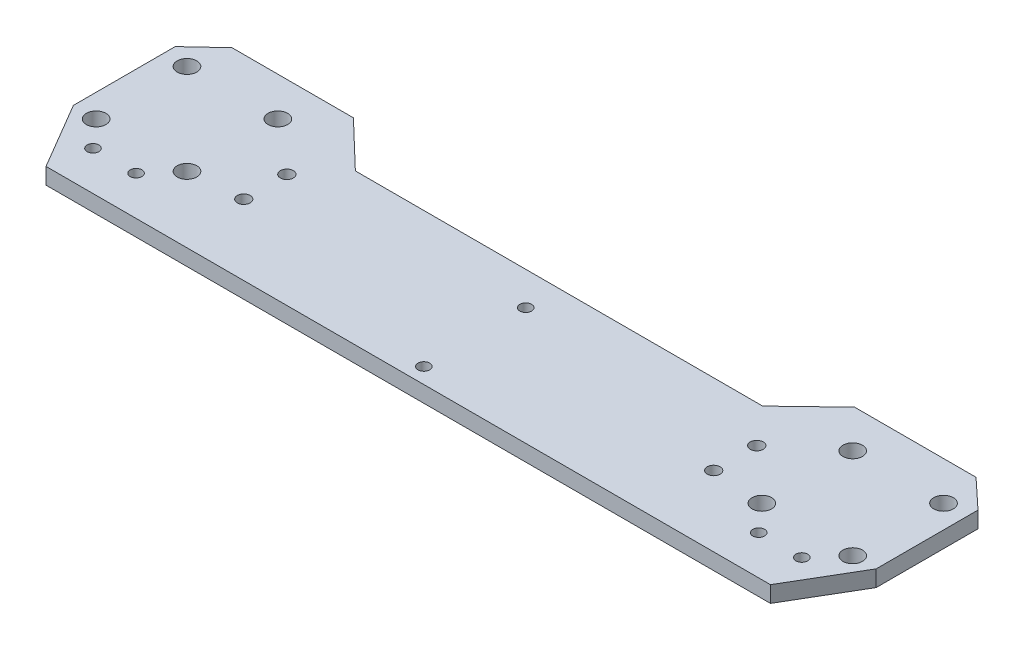
ISO-10303-21;
HEADER;
FILE_DESCRIPTION(('STEP AP214'),'2;1');
FILE_NAME('part.step','',(''),(''),'','','');
FILE_SCHEMA(('AUTOMOTIVE_DESIGN { 1 0 10303 214 1 1 1 1 }'));
ENDSEC;
DATA;
#1=APPLICATION_CONTEXT('core data for automotive mechanical design processes');
#2=APPLICATION_PROTOCOL_DEFINITION('international standard','automotive_design',2000,#1);
#3=PRODUCT_CONTEXT('',#1,'mechanical');
#4=PRODUCT('Part','Part','',(#3));
#5=PRODUCT_RELATED_PRODUCT_CATEGORY('part','',(#4));
#6=PRODUCT_DEFINITION_FORMATION('','',#4);
#7=PRODUCT_DEFINITION_CONTEXT('part definition',#1,'design');
#8=PRODUCT_DEFINITION('design','',#6,#7);
#9=PRODUCT_DEFINITION_SHAPE('','',#8);
#10=(LENGTH_UNIT() NAMED_UNIT(*) SI_UNIT(.MILLI.,.METRE.));
#11=(NAMED_UNIT(*) PLANE_ANGLE_UNIT() SI_UNIT($,.RADIAN.));
#12=(NAMED_UNIT(*) SI_UNIT($,.STERADIAN.) SOLID_ANGLE_UNIT());
#13=UNCERTAINTY_MEASURE_WITH_UNIT(LENGTH_MEASURE(1.E-05),#10,'distance_accuracy_value','');
#14=(GEOMETRIC_REPRESENTATION_CONTEXT(3) GLOBAL_UNCERTAINTY_ASSIGNED_CONTEXT((#13)) GLOBAL_UNIT_ASSIGNED_CONTEXT((#10,
#11,#12)) REPRESENTATION_CONTEXT('',''));
#15=CARTESIAN_POINT('',(0.,0.,0.));
#16=DIRECTION('',(0.,0.,1.));
#17=DIRECTION('',(1.,0.,0.));
#18=AXIS2_PLACEMENT_3D('',#15,#16,#17);
#19=CARTESIAN_POINT('',(64.,-209.15,-50.));
#20=DIRECTION('',(0.,0.,-1.));
#21=DIRECTION('',(-1.,0.,0.));
#22=AXIS2_PLACEMENT_3D('',#19,#20,#21);
#23=PLANE('',#22);
#24=DIRECTION('',(-1.,0.,0.));
#25=VECTOR('',#24,1.);
#26=CARTESIAN_POINT('',(64.,-205.,-50.));
#27=LINE('',#26,#25);
#28=CARTESIAN_POINT('',(95.,-205.,-50.));
#29=VERTEX_POINT('',#28);
#30=CARTESIAN_POINT('',(64.,-205.,-50.));
#31=VERTEX_POINT('',#30);
#32=EDGE_CURVE('E157',#29,#31,#27,.T.);
#33=ORIENTED_EDGE('',*,*,#32,.F.);
#34=DIRECTION('',(0.,1.,0.));
#35=VECTOR('',#34,1.);
#36=CARTESIAN_POINT('',(95.,-209.15,-50.));
#37=LINE('',#36,#35);
#38=CARTESIAN_POINT('',(95.,-209.15,-50.));
#39=VERTEX_POINT('',#38);
#40=EDGE_CURVE('E11',#39,#29,#37,.T.);
#41=ORIENTED_EDGE('',*,*,#40,.F.);
#42=DIRECTION('',(-1.,0.,0.));
#43=VECTOR('',#42,1.);
#44=CARTESIAN_POINT('',(64.,-209.15,-50.));
#45=LINE('',#44,#43);
#46=CARTESIAN_POINT('',(64.,-209.15,-50.));
#47=VERTEX_POINT('',#46);
#48=EDGE_CURVE('E190',#39,#47,#45,.T.);
#49=ORIENTED_EDGE('',*,*,#48,.T.);
#50=DIRECTION('',(0.,1.,0.));
#51=VECTOR('',#50,1.);
#52=CARTESIAN_POINT('',(64.,-209.15,-50.));
#53=LINE('',#52,#51);
#54=EDGE_CURVE('E39',#47,#31,#53,.T.);
#55=ORIENTED_EDGE('',*,*,#54,.T.);
#56=EDGE_LOOP('',(#33,#41,#49,#55));
#57=FACE_BOUND('',#56,.T.);
#58=ADVANCED_FACE('F36',(#57),#23,.T.);
#59=CARTESIAN_POINT('',(95.,-209.15,-50.));
#60=DIRECTION('',(0.682318250360011,0.,-0.731055268242869));
#61=DIRECTION('',(-0.731055268242869,0.,-0.682318250360011));
#62=AXIS2_PLACEMENT_3D('',#59,#60,#61);
#63=PLANE('',#62);
#64=DIRECTION('',(-0.731055268242869,0.,-0.682318250360011));
#65=VECTOR('',#64,1.);
#66=CARTESIAN_POINT('',(95.,-205.,-50.));
#67=LINE('',#66,#65);
#68=CARTESIAN_POINT('',(102.5,-205.,-43.));
#69=VERTEX_POINT('',#68);
#70=EDGE_CURVE('E188',#69,#29,#67,.T.);
#71=ORIENTED_EDGE('',*,*,#70,.F.);
#72=DIRECTION('',(0.,1.,0.));
#73=VECTOR('',#72,1.);
#74=CARTESIAN_POINT('',(102.5,-209.15,-43.));
#75=LINE('',#74,#73);
#76=CARTESIAN_POINT('',(102.5,-209.15,-43.));
#77=VERTEX_POINT('',#76);
#78=EDGE_CURVE('E45',#77,#69,#75,.T.);
#79=ORIENTED_EDGE('',*,*,#78,.F.);
#80=DIRECTION('',(-0.731055268242869,0.,-0.682318250360011));
#81=VECTOR('',#80,1.);
#82=CARTESIAN_POINT('',(95.,-209.15,-50.));
#83=LINE('',#82,#81);
#84=EDGE_CURVE('E147',#77,#39,#83,.T.);
#85=ORIENTED_EDGE('',*,*,#84,.T.);
#86=ORIENTED_EDGE('',*,*,#40,.T.);
#87=EDGE_LOOP('',(#71,#79,#85,#86));
#88=FACE_BOUND('',#87,.T.);
#89=ADVANCED_FACE('F210',(#88),#63,.T.);
#90=CARTESIAN_POINT('',(102.5,-209.15,-43.));
#91=DIRECTION('',(1.,0.,0.));
#92=DIRECTION('',(0.,0.,-1.));
#93=AXIS2_PLACEMENT_3D('',#90,#91,#92);
#94=PLANE('',#93);
#95=DIRECTION('',(0.,0.,-1.));
#96=VECTOR('',#95,1.);
#97=CARTESIAN_POINT('',(102.5,-205.,-43.));
#98=LINE('',#97,#96);
#99=CARTESIAN_POINT('',(102.5,-205.,-17.));
#100=VERTEX_POINT('',#99);
#101=EDGE_CURVE('E134',#100,#69,#98,.T.);
#102=ORIENTED_EDGE('',*,*,#101,.F.);
#103=DIRECTION('',(0.,1.,0.));
#104=VECTOR('',#103,1.);
#105=CARTESIAN_POINT('',(102.5,-209.15,-17.));
#106=LINE('',#105,#104);
#107=CARTESIAN_POINT('',(102.5,-209.15,-17.));
#108=VERTEX_POINT('',#107);
#109=EDGE_CURVE('E129',#108,#100,#106,.T.);
#110=ORIENTED_EDGE('',*,*,#109,.F.);
#111=DIRECTION('',(0.,0.,-1.));
#112=VECTOR('',#111,1.);
#113=CARTESIAN_POINT('',(102.5,-209.15,-43.));
#114=LINE('',#113,#112);
#115=EDGE_CURVE('E132',#108,#77,#114,.T.);
#116=ORIENTED_EDGE('',*,*,#115,.T.);
#117=ORIENTED_EDGE('',*,*,#78,.T.);
#118=EDGE_LOOP('',(#102,#110,#116,#117));
#119=FACE_BOUND('',#118,.T.);
#120=ADVANCED_FACE('F131',(#119),#94,.T.);
#121=CARTESIAN_POINT('',(102.5,-209.15,-17.));
#122=DIRECTION('',(0.86193421515777,0.,0.507020126563394));
#123=DIRECTION('',(0.507020126563394,0.,-0.86193421515777));
#124=AXIS2_PLACEMENT_3D('',#121,#122,#123);
#125=PLANE('',#124);
#126=DIRECTION('',(0.507020126563394,0.,-0.86193421515777));
#127=VECTOR('',#126,1.);
#128=CARTESIAN_POINT('',(102.5,-205.,-17.));
#129=LINE('',#128,#127);
#130=CARTESIAN_POINT('',(92.5,-205.,0.));
#131=VERTEX_POINT('',#130);
#132=EDGE_CURVE('E185',#131,#100,#129,.T.);
#133=ORIENTED_EDGE('',*,*,#132,.F.);
#134=DIRECTION('',(0.,1.,0.));
#135=VECTOR('',#134,1.);
#136=CARTESIAN_POINT('',(92.5,-209.15,0.));
#137=LINE('',#136,#135);
#138=CARTESIAN_POINT('',(92.5,-209.15,0.));
#139=VERTEX_POINT('',#138);
#140=EDGE_CURVE('E139',#139,#131,#137,.T.);
#141=ORIENTED_EDGE('',*,*,#140,.F.);
#142=DIRECTION('',(0.507020126563394,0.,-0.86193421515777));
#143=VECTOR('',#142,1.);
#144=CARTESIAN_POINT('',(102.5,-209.15,-17.));
#145=LINE('',#144,#143);
#146=EDGE_CURVE('E145',#139,#108,#145,.T.);
#147=ORIENTED_EDGE('',*,*,#146,.T.);
#148=ORIENTED_EDGE('',*,*,#109,.T.);
#149=EDGE_LOOP('',(#133,#141,#147,#148));
#150=FACE_BOUND('',#149,.T.);
#151=ADVANCED_FACE('F149',(#150),#125,.T.);
#152=CARTESIAN_POINT('',(-92.5,-209.15,0.));
#153=DIRECTION('',(0.,0.,1.));
#154=DIRECTION('',(1.,0.,0.));
#155=AXIS2_PLACEMENT_3D('',#152,#153,#154);
#156=PLANE('',#155);
#157=DIRECTION('',(1.,0.,0.));
#158=VECTOR('',#157,1.);
#159=CARTESIAN_POINT('',(-92.5,-205.,0.));
#160=LINE('',#159,#158);
#161=CARTESIAN_POINT('',(-92.5,-205.,0.));
#162=VERTEX_POINT('',#161);
#163=EDGE_CURVE('E182',#162,#131,#160,.T.);
#164=ORIENTED_EDGE('',*,*,#163,.F.);
#165=DIRECTION('',(0.,1.,0.));
#166=VECTOR('',#165,1.);
#167=CARTESIAN_POINT('',(-92.5,-209.15,0.));
#168=LINE('',#167,#166);
#169=CARTESIAN_POINT('',(-92.5,-209.15,0.));
#170=VERTEX_POINT('',#169);
#171=EDGE_CURVE('E194',#170,#162,#168,.T.);
#172=ORIENTED_EDGE('',*,*,#171,.F.);
#173=DIRECTION('',(1.,0.,0.));
#174=VECTOR('',#173,1.);
#175=CARTESIAN_POINT('',(-92.5,-209.15,0.));
#176=LINE('',#175,#174);
#177=EDGE_CURVE('E150',#170,#139,#176,.T.);
#178=ORIENTED_EDGE('',*,*,#177,.T.);
#179=ORIENTED_EDGE('',*,*,#140,.T.);
#180=EDGE_LOOP('',(#164,#172,#178,#179));
#181=FACE_BOUND('',#180,.T.);
#182=ADVANCED_FACE('F223',(#181),#156,.T.);
#183=CARTESIAN_POINT('',(-102.5,-209.15,-17.));
#184=DIRECTION('',(-0.86193421515777,0.,0.507020126563394));
#185=DIRECTION('',(0.507020126563394,0.,0.86193421515777));
#186=AXIS2_PLACEMENT_3D('',#183,#184,#185);
#187=PLANE('',#186);
#188=DIRECTION('',(0.507020126563394,0.,0.86193421515777));
#189=VECTOR('',#188,1.);
#190=CARTESIAN_POINT('',(-102.5,-205.,-17.));
#191=LINE('',#190,#189);
#192=CARTESIAN_POINT('',(-102.5,-205.,-17.));
#193=VERTEX_POINT('',#192);
#194=EDGE_CURVE('E179',#193,#162,#191,.T.);
#195=ORIENTED_EDGE('',*,*,#194,.F.);
#196=DIRECTION('',(0.,1.,0.));
#197=VECTOR('',#196,1.);
#198=CARTESIAN_POINT('',(-102.5,-209.15,-17.));
#199=LINE('',#198,#197);
#200=CARTESIAN_POINT('',(-102.5,-209.15,-17.));
#201=VERTEX_POINT('',#200);
#202=EDGE_CURVE('E196',#201,#193,#199,.T.);
#203=ORIENTED_EDGE('',*,*,#202,.F.);
#204=DIRECTION('',(0.507020126563394,0.,0.86193421515777));
#205=VECTOR('',#204,1.);
#206=CARTESIAN_POINT('',(-102.5,-209.15,-17.));
#207=LINE('',#206,#205);
#208=EDGE_CURVE('E152',#201,#170,#207,.T.);
#209=ORIENTED_EDGE('',*,*,#208,.T.);
#210=ORIENTED_EDGE('',*,*,#171,.T.);
#211=EDGE_LOOP('',(#195,#203,#209,#210));
#212=FACE_BOUND('',#211,.T.);
#213=ADVANCED_FACE('F226',(#212),#187,.T.);
#214=CARTESIAN_POINT('',(-102.5,-209.15,-43.));
#215=DIRECTION('',(-1.,0.,0.));
#216=DIRECTION('',(0.,0.,1.));
#217=AXIS2_PLACEMENT_3D('',#214,#215,#216);
#218=PLANE('',#217);
#219=DIRECTION('',(0.,0.,1.));
#220=VECTOR('',#219,1.);
#221=CARTESIAN_POINT('',(-102.5,-205.,-43.));
#222=LINE('',#221,#220);
#223=CARTESIAN_POINT('',(-102.5,-205.,-43.));
#224=VERTEX_POINT('',#223);
#225=EDGE_CURVE('E176',#224,#193,#222,.T.);
#226=ORIENTED_EDGE('',*,*,#225,.F.);
#227=DIRECTION('',(0.,1.,0.));
#228=VECTOR('',#227,1.);
#229=CARTESIAN_POINT('',(-102.5,-209.15,-43.));
#230=LINE('',#229,#228);
#231=CARTESIAN_POINT('',(-102.5,-209.15,-43.));
#232=VERTEX_POINT('',#231);
#233=EDGE_CURVE('E198',#232,#224,#230,.T.);
#234=ORIENTED_EDGE('',*,*,#233,.F.);
#235=DIRECTION('',(0.,0.,1.));
#236=VECTOR('',#235,1.);
#237=CARTESIAN_POINT('',(-102.5,-209.15,-43.));
#238=LINE('',#237,#236);
#239=EDGE_CURVE('E460',#232,#201,#238,.T.);
#240=ORIENTED_EDGE('',*,*,#239,.T.);
#241=ORIENTED_EDGE('',*,*,#202,.T.);
#242=EDGE_LOOP('',(#226,#234,#240,#241));
#243=FACE_BOUND('',#242,.T.);
#244=ADVANCED_FACE('F230',(#243),#218,.T.);
#245=CARTESIAN_POINT('',(-95.,-209.15,-50.));
#246=DIRECTION('',(-0.682318250360011,0.,-0.731055268242869));
#247=DIRECTION('',(-0.731055268242869,0.,0.682318250360011));
#248=AXIS2_PLACEMENT_3D('',#245,#246,#247);
#249=PLANE('',#248);
#250=DIRECTION('',(-0.731055268242869,0.,0.682318250360011));
#251=VECTOR('',#250,1.);
#252=CARTESIAN_POINT('',(-95.,-205.,-50.));
#253=LINE('',#252,#251);
#254=CARTESIAN_POINT('',(-95.,-205.,-50.));
#255=VERTEX_POINT('',#254);
#256=EDGE_CURVE('E173',#255,#224,#253,.T.);
#257=ORIENTED_EDGE('',*,*,#256,.F.);
#258=DIRECTION('',(0.,1.,0.));
#259=VECTOR('',#258,1.);
#260=CARTESIAN_POINT('',(-95.,-209.15,-50.));
#261=LINE('',#260,#259);
#262=CARTESIAN_POINT('',(-95.,-209.15,-50.));
#263=VERTEX_POINT('',#262);
#264=EDGE_CURVE('E200',#263,#255,#261,.T.);
#265=ORIENTED_EDGE('',*,*,#264,.F.);
#266=DIRECTION('',(-0.731055268242869,0.,0.682318250360011));
#267=VECTOR('',#266,1.);
#268=CARTESIAN_POINT('',(-95.,-209.15,-50.));
#269=LINE('',#268,#267);
#270=EDGE_CURVE('E457',#263,#232,#269,.T.);
#271=ORIENTED_EDGE('',*,*,#270,.T.);
#272=ORIENTED_EDGE('',*,*,#233,.T.);
#273=EDGE_LOOP('',(#257,#265,#271,#272));
#274=FACE_BOUND('',#273,.T.);
#275=ADVANCED_FACE('F234',(#274),#249,.T.);
#276=CARTESIAN_POINT('',(-64.,-209.15,-50.));
#277=DIRECTION('',(0.,0.,-1.));
#278=DIRECTION('',(-1.,0.,0.));
#279=AXIS2_PLACEMENT_3D('',#276,#277,#278);
#280=PLANE('',#279);
#281=DIRECTION('',(-1.,0.,0.));
#282=VECTOR('',#281,1.);
#283=CARTESIAN_POINT('',(-64.,-205.,-50.));
#284=LINE('',#283,#282);
#285=CARTESIAN_POINT('',(-64.,-205.,-50.));
#286=VERTEX_POINT('',#285);
#287=EDGE_CURVE('E170',#286,#255,#284,.T.);
#288=ORIENTED_EDGE('',*,*,#287,.F.);
#289=DIRECTION('',(0.,1.,0.));
#290=VECTOR('',#289,1.);
#291=CARTESIAN_POINT('',(-64.,-209.15,-50.));
#292=LINE('',#291,#290);
#293=CARTESIAN_POINT('',(-64.,-209.15,-50.));
#294=VERTEX_POINT('',#293);
#295=EDGE_CURVE('E202',#294,#286,#292,.T.);
#296=ORIENTED_EDGE('',*,*,#295,.F.);
#297=DIRECTION('',(-1.,0.,0.));
#298=VECTOR('',#297,1.);
#299=CARTESIAN_POINT('',(-64.,-209.15,-50.));
#300=LINE('',#299,#298);
#301=EDGE_CURVE('E454',#294,#263,#300,.T.);
#302=ORIENTED_EDGE('',*,*,#301,.T.);
#303=ORIENTED_EDGE('',*,*,#264,.T.);
#304=EDGE_LOOP('',(#288,#296,#302,#303));
#305=FACE_BOUND('',#304,.T.);
#306=ADVANCED_FACE('F238',(#305),#280,.T.);
#307=CARTESIAN_POINT('',(-52.,-209.15,-38.5));
#308=DIRECTION('',(0.691905363235614,0.,-0.721988205115425));
#309=DIRECTION('',(-0.721988205115425,0.,-0.691905363235614));
#310=AXIS2_PLACEMENT_3D('',#307,#308,#309);
#311=PLANE('',#310);
#312=DIRECTION('',(-0.721988205115425,0.,-0.691905363235614));
#313=VECTOR('',#312,1.);
#314=CARTESIAN_POINT('',(-52.,-205.,-38.5));
#315=LINE('',#314,#313);
#316=CARTESIAN_POINT('',(-52.,-205.,-38.5));
#317=VERTEX_POINT('',#316);
#318=EDGE_CURVE('E167',#317,#286,#315,.T.);
#319=ORIENTED_EDGE('',*,*,#318,.F.);
#320=DIRECTION('',(0.,1.,0.));
#321=VECTOR('',#320,1.);
#322=CARTESIAN_POINT('',(-52.,-209.15,-38.5));
#323=LINE('',#322,#321);
#324=CARTESIAN_POINT('',(-52.,-209.15,-38.5));
#325=VERTEX_POINT('',#324);
#326=EDGE_CURVE('E204',#325,#317,#323,.T.);
#327=ORIENTED_EDGE('',*,*,#326,.F.);
#328=DIRECTION('',(-0.721988205115425,0.,-0.691905363235614));
#329=VECTOR('',#328,1.);
#330=CARTESIAN_POINT('',(-52.,-209.15,-38.5));
#331=LINE('',#330,#329);
#332=EDGE_CURVE('E451',#325,#294,#331,.T.);
#333=ORIENTED_EDGE('',*,*,#332,.T.);
#334=ORIENTED_EDGE('',*,*,#295,.T.);
#335=EDGE_LOOP('',(#319,#327,#333,#334));
#336=FACE_BOUND('',#335,.T.);
#337=ADVANCED_FACE('F242',(#336),#311,.T.);
#338=CARTESIAN_POINT('',(52.,-209.15,-38.5));
#339=DIRECTION('',(0.,0.,-1.));
#340=DIRECTION('',(-1.,0.,0.));
#341=AXIS2_PLACEMENT_3D('',#338,#339,#340);
#342=PLANE('',#341);
#343=DIRECTION('',(-1.,0.,0.));
#344=VECTOR('',#343,1.);
#345=CARTESIAN_POINT('',(52.,-205.,-38.5));
#346=LINE('',#345,#344);
#347=CARTESIAN_POINT('',(52.,-205.,-38.5));
#348=VERTEX_POINT('',#347);
#349=EDGE_CURVE('E164',#348,#317,#346,.T.);
#350=ORIENTED_EDGE('',*,*,#349,.F.);
#351=DIRECTION('',(0.,1.,0.));
#352=VECTOR('',#351,1.);
#353=CARTESIAN_POINT('',(52.,-209.15,-38.5));
#354=LINE('',#353,#352);
#355=CARTESIAN_POINT('',(52.,-209.15,-38.5));
#356=VERTEX_POINT('',#355);
#357=EDGE_CURVE('E205',#356,#348,#354,.T.);
#358=ORIENTED_EDGE('',*,*,#357,.F.);
#359=DIRECTION('',(-1.,0.,0.));
#360=VECTOR('',#359,1.);
#361=CARTESIAN_POINT('',(52.,-209.15,-38.5));
#362=LINE('',#361,#360);
#363=EDGE_CURVE('E448',#356,#325,#362,.T.);
#364=ORIENTED_EDGE('',*,*,#363,.T.);
#365=ORIENTED_EDGE('',*,*,#326,.T.);
#366=EDGE_LOOP('',(#350,#358,#364,#365));
#367=FACE_BOUND('',#366,.T.);
#368=ADVANCED_FACE('F246',(#367),#342,.T.);
#369=CARTESIAN_POINT('',(52.,-209.15,-38.5));
#370=DIRECTION('',(-0.691905363235614,0.,-0.721988205115425));
#371=DIRECTION('',(-0.721988205115425,0.,0.691905363235614));
#372=AXIS2_PLACEMENT_3D('',#369,#370,#371);
#373=PLANE('',#372);
#374=DIRECTION('',(-0.721988205115425,0.,0.691905363235614));
#375=VECTOR('',#374,1.);
#376=CARTESIAN_POINT('',(52.,-205.,-38.5));
#377=LINE('',#376,#375);
#378=EDGE_CURVE('E160',#31,#348,#377,.T.);
#379=ORIENTED_EDGE('',*,*,#378,.F.);
#380=ORIENTED_EDGE('',*,*,#54,.F.);
#381=DIRECTION('',(-0.721988205115425,0.,0.691905363235614));
#382=VECTOR('',#381,1.);
#383=CARTESIAN_POINT('',(52.,-209.15,-38.5));
#384=LINE('',#383,#382);
#385=EDGE_CURVE('E446',#47,#356,#384,.T.);
#386=ORIENTED_EDGE('',*,*,#385,.T.);
#387=ORIENTED_EDGE('',*,*,#357,.T.);
#388=EDGE_LOOP('',(#379,#380,#386,#387));
#389=FACE_BOUND('',#388,.T.);
#390=ADVANCED_FACE('F207',(#389),#373,.T.);
#391=CARTESIAN_POINT('',(0.,-209.15,0.));
#392=DIRECTION('',(0.,-1.,0.));
#393=DIRECTION('',(0.,0.,-1.));
#394=AXIS2_PLACEMENT_3D('',#391,#392,#393);
#395=PLANE('',#394);
#396=CARTESIAN_POINT('',(-96.6,-209.15,-40.1));
#397=DIRECTION('',(0.,1.,0.));
#398=DIRECTION('',(0.,0.,1.));
#399=AXIS2_PLACEMENT_3D('',#396,#397,#398);
#400=CIRCLE('',#399,2.50000000000001);
#401=CARTESIAN_POINT('',(-96.6,-209.15,-37.6));
#402=VERTEX_POINT('',#401);
#403=EDGE_CURVE('E337',#402,#402,#400,.T.);
#404=ORIENTED_EDGE('',*,*,#403,.T.);
#405=EDGE_LOOP('',(#404));
#406=FACE_BOUND('',#405,.T.);
#407=CARTESIAN_POINT('',(96.6,-209.15,-40.1));
#408=DIRECTION('',(0.,1.,0.));
#409=DIRECTION('',(0.,0.,-1.));
#410=AXIS2_PLACEMENT_3D('',#407,#408,#409);
#411=CIRCLE('',#410,2.49999999999997);
#412=CARTESIAN_POINT('',(96.6,-209.15,-42.6));
#413=VERTEX_POINT('',#412);
#414=EDGE_CURVE('E345',#413,#413,#411,.T.);
#415=ORIENTED_EDGE('',*,*,#414,.T.);
#416=EDGE_LOOP('',(#415));
#417=FACE_BOUND('',#416,.T.);
#418=CARTESIAN_POINT('',(96.6,-209.15,-16.9));
#419=DIRECTION('',(0.,1.,0.));
#420=DIRECTION('',(0.,0.,-1.));
#421=AXIS2_PLACEMENT_3D('',#418,#419,#420);
#422=CIRCLE('',#421,2.49999999999997);
#423=CARTESIAN_POINT('',(96.6,-209.15,-19.4));
#424=VERTEX_POINT('',#423);
#425=EDGE_CURVE('E351',#424,#424,#422,.T.);
#426=ORIENTED_EDGE('',*,*,#425,.T.);
#427=EDGE_LOOP('',(#426));
#428=FACE_BOUND('',#427,.T.);
#429=CARTESIAN_POINT('',(90.5,-209.15,-10.));
#430=DIRECTION('',(0.,1.,0.));
#431=DIRECTION('',(0.,0.,-1.));
#432=AXIS2_PLACEMENT_3D('',#429,#430,#431);
#433=CIRCLE('',#432,1.49999999999997);
#434=CARTESIAN_POINT('',(90.5,-209.15,-11.5));
#435=VERTEX_POINT('',#434);
#436=EDGE_CURVE('E357',#435,#435,#433,.T.);
#437=ORIENTED_EDGE('',*,*,#436,.T.);
#438=EDGE_LOOP('',(#437));
#439=FACE_BOUND('',#438,.T.);
#440=CARTESIAN_POINT('',(79.5,-209.15,-10.));
#441=DIRECTION('',(0.,1.,0.));
#442=DIRECTION('',(0.,0.,-1.));
#443=AXIS2_PLACEMENT_3D('',#440,#441,#442);
#444=CIRCLE('',#443,1.50000000000003);
#445=CARTESIAN_POINT('',(79.5,-209.15,-11.5));
#446=VERTEX_POINT('',#445);
#447=EDGE_CURVE('E363',#446,#446,#444,.T.);
#448=ORIENTED_EDGE('',*,*,#447,.T.);
#449=EDGE_LOOP('',(#448));
#450=FACE_BOUND('',#449,.T.);
#451=CARTESIAN_POINT('',(73.4,-209.15,-16.9));
#452=DIRECTION('',(0.,1.,0.));
#453=DIRECTION('',(0.,0.,-1.));
#454=AXIS2_PLACEMENT_3D('',#451,#452,#453);
#455=CIRCLE('',#454,2.49999999999997);
#456=CARTESIAN_POINT('',(73.4,-209.15,-19.4));
#457=VERTEX_POINT('',#456);
#458=EDGE_CURVE('E369',#457,#457,#455,.T.);
#459=ORIENTED_EDGE('',*,*,#458,.T.);
#460=EDGE_LOOP('',(#459));
#461=FACE_BOUND('',#460,.T.);
#462=CARTESIAN_POINT('',(60.,-209.15,-18.));
#463=DIRECTION('',(0.,1.,0.));
#464=DIRECTION('',(0.,0.,-1.));
#465=AXIS2_PLACEMENT_3D('',#462,#463,#464);
#466=CIRCLE('',#465,1.65000000000001);
#467=CARTESIAN_POINT('',(60.,-209.15,-19.65));
#468=VERTEX_POINT('',#467);
#469=EDGE_CURVE('E375',#468,#468,#466,.T.);
#470=ORIENTED_EDGE('',*,*,#469,.T.);
#471=EDGE_LOOP('',(#470));
#472=FACE_BOUND('',#471,.T.);
#473=CARTESIAN_POINT('',(60.,-209.15,-29.));
#474=DIRECTION('',(0.,1.,0.));
#475=DIRECTION('',(0.,0.,-1.));
#476=AXIS2_PLACEMENT_3D('',#473,#474,#475);
#477=CIRCLE('',#476,1.65000000000002);
#478=CARTESIAN_POINT('',(60.,-209.15,-30.65));
#479=VERTEX_POINT('',#478);
#480=EDGE_CURVE('E381',#479,#479,#477,.T.);
#481=ORIENTED_EDGE('',*,*,#480,.T.);
#482=EDGE_LOOP('',(#481));
#483=FACE_BOUND('',#482,.T.);
#484=CARTESIAN_POINT('',(73.4,-209.15,-40.1));
#485=DIRECTION('',(0.,1.,0.));
#486=DIRECTION('',(0.,0.,-1.));
#487=AXIS2_PLACEMENT_3D('',#484,#485,#486);
#488=CIRCLE('',#487,2.49999999999997);
#489=CARTESIAN_POINT('',(73.4,-209.15,-42.6));
#490=VERTEX_POINT('',#489);
#491=EDGE_CURVE('E387',#490,#490,#488,.T.);
#492=ORIENTED_EDGE('',*,*,#491,.T.);
#493=EDGE_LOOP('',(#492));
#494=FACE_BOUND('',#493,.T.);
#495=CARTESIAN_POINT('',(0.,-209.15,-4.00000000000001));
#496=DIRECTION('',(0.,1.,0.));
#497=DIRECTION('',(0.,0.,1.));
#498=AXIS2_PLACEMENT_3D('',#495,#496,#497);
#499=CIRCLE('',#498,1.5);
#500=CARTESIAN_POINT('',(0.,-209.15,-2.50000000000002));
#501=VERTEX_POINT('',#500);
#502=EDGE_CURVE('E393',#501,#501,#499,.T.);
#503=ORIENTED_EDGE('',*,*,#502,.T.);
#504=EDGE_LOOP('',(#503));
#505=FACE_BOUND('',#504,.T.);
#506=CARTESIAN_POINT('',(0.,-209.15,-30.));
#507=DIRECTION('',(0.,1.,0.));
#508=DIRECTION('',(0.,0.,1.));
#509=AXIS2_PLACEMENT_3D('',#506,#507,#508);
#510=CIRCLE('',#509,1.5);
#511=CARTESIAN_POINT('',(0.,-209.15,-28.5));
#512=VERTEX_POINT('',#511);
#513=EDGE_CURVE('E399',#512,#512,#510,.T.);
#514=ORIENTED_EDGE('',*,*,#513,.T.);
#515=EDGE_LOOP('',(#514));
#516=FACE_BOUND('',#515,.T.);
#517=CARTESIAN_POINT('',(-60.,-209.15,-18.));
#518=DIRECTION('',(0.,1.,0.));
#519=DIRECTION('',(0.,0.,1.));
#520=AXIS2_PLACEMENT_3D('',#517,#518,#519);
#521=CIRCLE('',#520,1.65000000000001);
#522=CARTESIAN_POINT('',(-60.,-209.15,-16.35));
#523=VERTEX_POINT('',#522);
#524=EDGE_CURVE('E405',#523,#523,#521,.T.);
#525=ORIENTED_EDGE('',*,*,#524,.T.);
#526=EDGE_LOOP('',(#525));
#527=FACE_BOUND('',#526,.T.);
#528=CARTESIAN_POINT('',(-60.,-209.15,-29.));
#529=DIRECTION('',(0.,1.,0.));
#530=DIRECTION('',(0.,0.,1.));
#531=AXIS2_PLACEMENT_3D('',#528,#529,#530);
#532=CIRCLE('',#531,1.65000000000002);
#533=CARTESIAN_POINT('',(-60.,-209.15,-27.35));
#534=VERTEX_POINT('',#533);
#535=EDGE_CURVE('E411',#534,#534,#532,.T.);
#536=ORIENTED_EDGE('',*,*,#535,.T.);
#537=EDGE_LOOP('',(#536));
#538=FACE_BOUND('',#537,.T.);
#539=CARTESIAN_POINT('',(-79.5,-209.15,-9.99999999999999));
#540=DIRECTION('',(0.,1.,0.));
#541=DIRECTION('',(0.,0.,1.));
#542=AXIS2_PLACEMENT_3D('',#539,#540,#541);
#543=CIRCLE('',#542,1.5);
#544=CARTESIAN_POINT('',(-79.5,-209.15,-8.5));
#545=VERTEX_POINT('',#544);
#546=EDGE_CURVE('E417',#545,#545,#543,.T.);
#547=ORIENTED_EDGE('',*,*,#546,.T.);
#548=EDGE_LOOP('',(#547));
#549=FACE_BOUND('',#548,.T.);
#550=CARTESIAN_POINT('',(-90.5,-209.15,-9.99999999999999));
#551=DIRECTION('',(0.,1.,0.));
#552=DIRECTION('',(0.,0.,1.));
#553=AXIS2_PLACEMENT_3D('',#550,#551,#552);
#554=CIRCLE('',#553,1.5);
#555=CARTESIAN_POINT('',(-90.5,-209.15,-8.49999999999999));
#556=VERTEX_POINT('',#555);
#557=EDGE_CURVE('E423',#556,#556,#554,.T.);
#558=ORIENTED_EDGE('',*,*,#557,.T.);
#559=EDGE_LOOP('',(#558));
#560=FACE_BOUND('',#559,.T.);
#561=CARTESIAN_POINT('',(-73.4,-209.15,-16.9));
#562=DIRECTION('',(0.,1.,0.));
#563=DIRECTION('',(0.,0.,1.));
#564=AXIS2_PLACEMENT_3D('',#561,#562,#563);
#565=CIRCLE('',#564,2.50000000000001);
#566=CARTESIAN_POINT('',(-73.4,-209.15,-14.4));
#567=VERTEX_POINT('',#566);
#568=EDGE_CURVE('E429',#567,#567,#565,.T.);
#569=ORIENTED_EDGE('',*,*,#568,.T.);
#570=EDGE_LOOP('',(#569));
#571=FACE_BOUND('',#570,.T.);
#572=CARTESIAN_POINT('',(-96.6,-209.15,-16.9));
#573=DIRECTION('',(0.,1.,0.));
#574=DIRECTION('',(0.,0.,1.));
#575=AXIS2_PLACEMENT_3D('',#572,#573,#574);
#576=CIRCLE('',#575,2.49999999999999);
#577=CARTESIAN_POINT('',(-96.6,-209.15,-14.4));
#578=VERTEX_POINT('',#577);
#579=EDGE_CURVE('E435',#578,#578,#576,.T.);
#580=ORIENTED_EDGE('',*,*,#579,.T.);
#581=EDGE_LOOP('',(#580));
#582=FACE_BOUND('',#581,.T.);
#583=CARTESIAN_POINT('',(-73.4,-209.15,-40.1));
#584=DIRECTION('',(0.,1.,0.));
#585=DIRECTION('',(0.,0.,1.));
#586=AXIS2_PLACEMENT_3D('',#583,#584,#585);
#587=CIRCLE('',#586,2.49999999999999);
#588=CARTESIAN_POINT('',(-73.4,-209.15,-37.6));
#589=VERTEX_POINT('',#588);
#590=EDGE_CURVE('E161',#589,#589,#587,.T.);
#591=ORIENTED_EDGE('',*,*,#590,.T.);
#592=EDGE_LOOP('',(#591));
#593=FACE_BOUND('',#592,.T.);
#594=ORIENTED_EDGE('',*,*,#48,.F.);
#595=ORIENTED_EDGE('',*,*,#84,.F.);
#596=ORIENTED_EDGE('',*,*,#115,.F.);
#597=ORIENTED_EDGE('',*,*,#146,.F.);
#598=ORIENTED_EDGE('',*,*,#177,.F.);
#599=ORIENTED_EDGE('',*,*,#208,.F.);
#600=ORIENTED_EDGE('',*,*,#239,.F.);
#601=ORIENTED_EDGE('',*,*,#270,.F.);
#602=ORIENTED_EDGE('',*,*,#301,.F.);
#603=ORIENTED_EDGE('',*,*,#332,.F.);
#604=ORIENTED_EDGE('',*,*,#363,.F.);
#605=ORIENTED_EDGE('',*,*,#385,.F.);
#606=EDGE_LOOP('',(#594,#595,#596,#597,#598,#599,#600,#601,#602,#603,#604,#605));
#607=FACE_BOUND('',#606,.T.);
#608=ADVANCED_FACE('F143',(#406,#417,#428,#439,#450,#461,#472,#483,#494,#505,#516,#527,#538,
#549,#560,#571,#582,#593,#607),#395,.T.);
#609=CARTESIAN_POINT('',(0.,-205.,0.));
#610=DIRECTION('',(0.,-1.,0.));
#611=DIRECTION('',(0.,0.,-1.));
#612=AXIS2_PLACEMENT_3D('',#609,#610,#611);
#613=PLANE('',#612);
#614=CARTESIAN_POINT('',(-96.6,-205.,-40.1));
#615=DIRECTION('',(0.,1.,0.));
#616=DIRECTION('',(0.,0.,1.));
#617=AXIS2_PLACEMENT_3D('',#614,#615,#616);
#618=CIRCLE('',#617,2.50000000000001);
#619=CARTESIAN_POINT('',(-96.6,-205.,-37.6));
#620=VERTEX_POINT('',#619);
#621=EDGE_CURVE('E340',#620,#620,#618,.T.);
#622=ORIENTED_EDGE('',*,*,#621,.F.);
#623=EDGE_LOOP('',(#622));
#624=FACE_BOUND('',#623,.T.);
#625=CARTESIAN_POINT('',(96.6,-205.,-40.1));
#626=DIRECTION('',(0.,1.,0.));
#627=DIRECTION('',(0.,0.,-1.));
#628=AXIS2_PLACEMENT_3D('',#625,#626,#627);
#629=CIRCLE('',#628,2.49999999999997);
#630=CARTESIAN_POINT('',(96.6,-205.,-42.6));
#631=VERTEX_POINT('',#630);
#632=EDGE_CURVE('E342',#631,#631,#629,.T.);
#633=ORIENTED_EDGE('',*,*,#632,.F.);
#634=EDGE_LOOP('',(#633));
#635=FACE_BOUND('',#634,.T.);
#636=CARTESIAN_POINT('',(96.6,-205.,-16.9));
#637=DIRECTION('',(0.,1.,0.));
#638=DIRECTION('',(0.,0.,-1.));
#639=AXIS2_PLACEMENT_3D('',#636,#637,#638);
#640=CIRCLE('',#639,2.49999999999997);
#641=CARTESIAN_POINT('',(96.6,-205.,-19.4));
#642=VERTEX_POINT('',#641);
#643=EDGE_CURVE('E348',#642,#642,#640,.T.);
#644=ORIENTED_EDGE('',*,*,#643,.F.);
#645=EDGE_LOOP('',(#644));
#646=FACE_BOUND('',#645,.T.);
#647=CARTESIAN_POINT('',(90.5,-205.,-10.));
#648=DIRECTION('',(0.,1.,0.));
#649=DIRECTION('',(0.,0.,-1.));
#650=AXIS2_PLACEMENT_3D('',#647,#648,#649);
#651=CIRCLE('',#650,1.49999999999997);
#652=CARTESIAN_POINT('',(90.5,-205.,-11.5));
#653=VERTEX_POINT('',#652);
#654=EDGE_CURVE('E354',#653,#653,#651,.T.);
#655=ORIENTED_EDGE('',*,*,#654,.F.);
#656=EDGE_LOOP('',(#655));
#657=FACE_BOUND('',#656,.T.);
#658=CARTESIAN_POINT('',(79.5,-205.,-10.));
#659=DIRECTION('',(0.,1.,0.));
#660=DIRECTION('',(0.,0.,-1.));
#661=AXIS2_PLACEMENT_3D('',#658,#659,#660);
#662=CIRCLE('',#661,1.50000000000003);
#663=CARTESIAN_POINT('',(79.5,-205.,-11.5));
#664=VERTEX_POINT('',#663);
#665=EDGE_CURVE('E360',#664,#664,#662,.T.);
#666=ORIENTED_EDGE('',*,*,#665,.F.);
#667=EDGE_LOOP('',(#666));
#668=FACE_BOUND('',#667,.T.);
#669=CARTESIAN_POINT('',(73.4,-205.,-16.9));
#670=DIRECTION('',(0.,1.,0.));
#671=DIRECTION('',(0.,0.,-1.));
#672=AXIS2_PLACEMENT_3D('',#669,#670,#671);
#673=CIRCLE('',#672,2.49999999999997);
#674=CARTESIAN_POINT('',(73.4,-205.,-19.4));
#675=VERTEX_POINT('',#674);
#676=EDGE_CURVE('E366',#675,#675,#673,.T.);
#677=ORIENTED_EDGE('',*,*,#676,.F.);
#678=EDGE_LOOP('',(#677));
#679=FACE_BOUND('',#678,.T.);
#680=CARTESIAN_POINT('',(60.,-205.,-18.));
#681=DIRECTION('',(0.,1.,0.));
#682=DIRECTION('',(0.,0.,-1.));
#683=AXIS2_PLACEMENT_3D('',#680,#681,#682);
#684=CIRCLE('',#683,1.65000000000001);
#685=CARTESIAN_POINT('',(60.,-205.,-19.65));
#686=VERTEX_POINT('',#685);
#687=EDGE_CURVE('E372',#686,#686,#684,.T.);
#688=ORIENTED_EDGE('',*,*,#687,.F.);
#689=EDGE_LOOP('',(#688));
#690=FACE_BOUND('',#689,.T.);
#691=CARTESIAN_POINT('',(60.,-205.,-29.));
#692=DIRECTION('',(0.,1.,0.));
#693=DIRECTION('',(0.,0.,-1.));
#694=AXIS2_PLACEMENT_3D('',#691,#692,#693);
#695=CIRCLE('',#694,1.65000000000002);
#696=CARTESIAN_POINT('',(60.,-205.,-30.65));
#697=VERTEX_POINT('',#696);
#698=EDGE_CURVE('E378',#697,#697,#695,.T.);
#699=ORIENTED_EDGE('',*,*,#698,.F.);
#700=EDGE_LOOP('',(#699));
#701=FACE_BOUND('',#700,.T.);
#702=CARTESIAN_POINT('',(73.4,-205.,-40.1));
#703=DIRECTION('',(0.,1.,0.));
#704=DIRECTION('',(0.,0.,-1.));
#705=AXIS2_PLACEMENT_3D('',#702,#703,#704);
#706=CIRCLE('',#705,2.49999999999997);
#707=CARTESIAN_POINT('',(73.4,-205.,-42.6));
#708=VERTEX_POINT('',#707);
#709=EDGE_CURVE('E384',#708,#708,#706,.T.);
#710=ORIENTED_EDGE('',*,*,#709,.F.);
#711=EDGE_LOOP('',(#710));
#712=FACE_BOUND('',#711,.T.);
#713=CARTESIAN_POINT('',(0.,-205.,-4.00000000000001));
#714=DIRECTION('',(0.,1.,0.));
#715=DIRECTION('',(0.,0.,1.));
#716=AXIS2_PLACEMENT_3D('',#713,#714,#715);
#717=CIRCLE('',#716,1.5);
#718=CARTESIAN_POINT('',(0.,-205.,-2.50000000000002));
#719=VERTEX_POINT('',#718);
#720=EDGE_CURVE('E390',#719,#719,#717,.T.);
#721=ORIENTED_EDGE('',*,*,#720,.F.);
#722=EDGE_LOOP('',(#721));
#723=FACE_BOUND('',#722,.T.);
#724=CARTESIAN_POINT('',(0.,-205.,-30.));
#725=DIRECTION('',(0.,1.,0.));
#726=DIRECTION('',(0.,0.,1.));
#727=AXIS2_PLACEMENT_3D('',#724,#725,#726);
#728=CIRCLE('',#727,1.5);
#729=CARTESIAN_POINT('',(0.,-205.,-28.5));
#730=VERTEX_POINT('',#729);
#731=EDGE_CURVE('E396',#730,#730,#728,.T.);
#732=ORIENTED_EDGE('',*,*,#731,.F.);
#733=EDGE_LOOP('',(#732));
#734=FACE_BOUND('',#733,.T.);
#735=CARTESIAN_POINT('',(-60.,-205.,-18.));
#736=DIRECTION('',(0.,1.,0.));
#737=DIRECTION('',(0.,0.,1.));
#738=AXIS2_PLACEMENT_3D('',#735,#736,#737);
#739=CIRCLE('',#738,1.65000000000001);
#740=CARTESIAN_POINT('',(-60.,-205.,-16.35));
#741=VERTEX_POINT('',#740);
#742=EDGE_CURVE('E402',#741,#741,#739,.T.);
#743=ORIENTED_EDGE('',*,*,#742,.F.);
#744=EDGE_LOOP('',(#743));
#745=FACE_BOUND('',#744,.T.);
#746=CARTESIAN_POINT('',(-60.,-205.,-29.));
#747=DIRECTION('',(0.,1.,0.));
#748=DIRECTION('',(0.,0.,1.));
#749=AXIS2_PLACEMENT_3D('',#746,#747,#748);
#750=CIRCLE('',#749,1.65000000000002);
#751=CARTESIAN_POINT('',(-60.,-205.,-27.35));
#752=VERTEX_POINT('',#751);
#753=EDGE_CURVE('E408',#752,#752,#750,.T.);
#754=ORIENTED_EDGE('',*,*,#753,.F.);
#755=EDGE_LOOP('',(#754));
#756=FACE_BOUND('',#755,.T.);
#757=CARTESIAN_POINT('',(-79.5,-205.,-9.99999999999999));
#758=DIRECTION('',(0.,1.,0.));
#759=DIRECTION('',(0.,0.,1.));
#760=AXIS2_PLACEMENT_3D('',#757,#758,#759);
#761=CIRCLE('',#760,1.5);
#762=CARTESIAN_POINT('',(-79.5,-205.,-8.5));
#763=VERTEX_POINT('',#762);
#764=EDGE_CURVE('E414',#763,#763,#761,.T.);
#765=ORIENTED_EDGE('',*,*,#764,.F.);
#766=EDGE_LOOP('',(#765));
#767=FACE_BOUND('',#766,.T.);
#768=CARTESIAN_POINT('',(-90.5,-205.,-9.99999999999999));
#769=DIRECTION('',(0.,1.,0.));
#770=DIRECTION('',(0.,0.,1.));
#771=AXIS2_PLACEMENT_3D('',#768,#769,#770);
#772=CIRCLE('',#771,1.5);
#773=CARTESIAN_POINT('',(-90.5,-205.,-8.49999999999999));
#774=VERTEX_POINT('',#773);
#775=EDGE_CURVE('E420',#774,#774,#772,.T.);
#776=ORIENTED_EDGE('',*,*,#775,.F.);
#777=EDGE_LOOP('',(#776));
#778=FACE_BOUND('',#777,.T.);
#779=CARTESIAN_POINT('',(-73.4,-205.,-16.9));
#780=DIRECTION('',(0.,1.,0.));
#781=DIRECTION('',(0.,0.,1.));
#782=AXIS2_PLACEMENT_3D('',#779,#780,#781);
#783=CIRCLE('',#782,2.50000000000001);
#784=CARTESIAN_POINT('',(-73.4,-205.,-14.4));
#785=VERTEX_POINT('',#784);
#786=EDGE_CURVE('E426',#785,#785,#783,.T.);
#787=ORIENTED_EDGE('',*,*,#786,.F.);
#788=EDGE_LOOP('',(#787));
#789=FACE_BOUND('',#788,.T.);
#790=CARTESIAN_POINT('',(-96.6,-205.,-16.9));
#791=DIRECTION('',(0.,1.,0.));
#792=DIRECTION('',(0.,0.,1.));
#793=AXIS2_PLACEMENT_3D('',#790,#791,#792);
#794=CIRCLE('',#793,2.49999999999999);
#795=CARTESIAN_POINT('',(-96.6,-205.,-14.4));
#796=VERTEX_POINT('',#795);
#797=EDGE_CURVE('E432',#796,#796,#794,.T.);
#798=ORIENTED_EDGE('',*,*,#797,.F.);
#799=EDGE_LOOP('',(#798));
#800=FACE_BOUND('',#799,.T.);
#801=CARTESIAN_POINT('',(-73.4,-205.,-40.1));
#802=DIRECTION('',(0.,1.,0.));
#803=DIRECTION('',(0.,0.,1.));
#804=AXIS2_PLACEMENT_3D('',#801,#802,#803);
#805=CIRCLE('',#804,2.49999999999999);
#806=CARTESIAN_POINT('',(-73.4,-205.,-37.6));
#807=VERTEX_POINT('',#806);
#808=EDGE_CURVE('E438',#807,#807,#805,.T.);
#809=ORIENTED_EDGE('',*,*,#808,.F.);
#810=EDGE_LOOP('',(#809));
#811=FACE_BOUND('',#810,.T.);
#812=ORIENTED_EDGE('',*,*,#32,.T.);
#813=ORIENTED_EDGE('',*,*,#378,.T.);
#814=ORIENTED_EDGE('',*,*,#349,.T.);
#815=ORIENTED_EDGE('',*,*,#318,.T.);
#816=ORIENTED_EDGE('',*,*,#287,.T.);
#817=ORIENTED_EDGE('',*,*,#256,.T.);
#818=ORIENTED_EDGE('',*,*,#225,.T.);
#819=ORIENTED_EDGE('',*,*,#194,.T.);
#820=ORIENTED_EDGE('',*,*,#163,.T.);
#821=ORIENTED_EDGE('',*,*,#132,.T.);
#822=ORIENTED_EDGE('',*,*,#101,.T.);
#823=ORIENTED_EDGE('',*,*,#70,.T.);
#824=EDGE_LOOP('',(#812,#813,#814,#815,#816,#817,#818,#819,#820,#821,#822,#823));
#825=FACE_BOUND('',#824,.T.);
#826=ADVANCED_FACE('F209',(#624,#635,#646,#657,#668,#679,#690,#701,#712,#723,#734,#745,#756,
#767,#778,#789,#800,#811,#825),#613,.F.);
#827=CARTESIAN_POINT('',(-73.4,-209.15,-40.1));
#828=DIRECTION('',(0.,1.,0.));
#829=DIRECTION('',(0.,0.,1.));
#830=AXIS2_PLACEMENT_3D('',#827,#828,#829);
#831=CYLINDRICAL_SURFACE('',#830,2.49999999999999);
#832=ORIENTED_EDGE('',*,*,#590,.F.);
#833=EDGE_LOOP('',(#832));
#834=FACE_BOUND('',#833,.T.);
#835=ORIENTED_EDGE('',*,*,#808,.T.);
#836=EDGE_LOOP('',(#835));
#837=FACE_BOUND('',#836,.T.);
#838=ADVANCED_FACE('F258',(#834,#837),#831,.F.);
#839=CARTESIAN_POINT('',(-96.6,-209.15,-16.9));
#840=DIRECTION('',(0.,1.,0.));
#841=DIRECTION('',(0.,0.,1.));
#842=AXIS2_PLACEMENT_3D('',#839,#840,#841);
#843=CYLINDRICAL_SURFACE('',#842,2.49999999999999);
#844=ORIENTED_EDGE('',*,*,#579,.F.);
#845=EDGE_LOOP('',(#844));
#846=FACE_BOUND('',#845,.T.);
#847=ORIENTED_EDGE('',*,*,#797,.T.);
#848=EDGE_LOOP('',(#847));
#849=FACE_BOUND('',#848,.T.);
#850=ADVANCED_FACE('F265',(#846,#849),#843,.F.);
#851=CARTESIAN_POINT('',(-73.4,-209.15,-16.9));
#852=DIRECTION('',(0.,1.,0.));
#853=DIRECTION('',(0.,0.,1.));
#854=AXIS2_PLACEMENT_3D('',#851,#852,#853);
#855=CYLINDRICAL_SURFACE('',#854,2.50000000000001);
#856=ORIENTED_EDGE('',*,*,#568,.F.);
#857=EDGE_LOOP('',(#856));
#858=FACE_BOUND('',#857,.T.);
#859=ORIENTED_EDGE('',*,*,#786,.T.);
#860=EDGE_LOOP('',(#859));
#861=FACE_BOUND('',#860,.T.);
#862=ADVANCED_FACE('F269',(#858,#861),#855,.F.);
#863=CARTESIAN_POINT('',(-90.5,-209.15,-9.99999999999999));
#864=DIRECTION('',(0.,1.,0.));
#865=DIRECTION('',(0.,0.,1.));
#866=AXIS2_PLACEMENT_3D('',#863,#864,#865);
#867=CYLINDRICAL_SURFACE('',#866,1.5);
#868=ORIENTED_EDGE('',*,*,#557,.F.);
#869=EDGE_LOOP('',(#868));
#870=FACE_BOUND('',#869,.T.);
#871=ORIENTED_EDGE('',*,*,#775,.T.);
#872=EDGE_LOOP('',(#871));
#873=FACE_BOUND('',#872,.T.);
#874=ADVANCED_FACE('F273',(#870,#873),#867,.F.);
#875=CARTESIAN_POINT('',(-79.5,-209.15,-9.99999999999999));
#876=DIRECTION('',(0.,1.,0.));
#877=DIRECTION('',(0.,0.,1.));
#878=AXIS2_PLACEMENT_3D('',#875,#876,#877);
#879=CYLINDRICAL_SURFACE('',#878,1.5);
#880=ORIENTED_EDGE('',*,*,#546,.F.);
#881=EDGE_LOOP('',(#880));
#882=FACE_BOUND('',#881,.T.);
#883=ORIENTED_EDGE('',*,*,#764,.T.);
#884=EDGE_LOOP('',(#883));
#885=FACE_BOUND('',#884,.T.);
#886=ADVANCED_FACE('F277',(#882,#885),#879,.F.);
#887=CARTESIAN_POINT('',(-60.,-209.15,-29.));
#888=DIRECTION('',(0.,1.,0.));
#889=DIRECTION('',(0.,0.,1.));
#890=AXIS2_PLACEMENT_3D('',#887,#888,#889);
#891=CYLINDRICAL_SURFACE('',#890,1.65000000000002);
#892=ORIENTED_EDGE('',*,*,#535,.F.);
#893=EDGE_LOOP('',(#892));
#894=FACE_BOUND('',#893,.T.);
#895=ORIENTED_EDGE('',*,*,#753,.T.);
#896=EDGE_LOOP('',(#895));
#897=FACE_BOUND('',#896,.T.);
#898=ADVANCED_FACE('F281',(#894,#897),#891,.F.);
#899=CARTESIAN_POINT('',(-60.,-209.15,-18.));
#900=DIRECTION('',(0.,1.,0.));
#901=DIRECTION('',(0.,0.,1.));
#902=AXIS2_PLACEMENT_3D('',#899,#900,#901);
#903=CYLINDRICAL_SURFACE('',#902,1.65000000000001);
#904=ORIENTED_EDGE('',*,*,#524,.F.);
#905=EDGE_LOOP('',(#904));
#906=FACE_BOUND('',#905,.T.);
#907=ORIENTED_EDGE('',*,*,#742,.T.);
#908=EDGE_LOOP('',(#907));
#909=FACE_BOUND('',#908,.T.);
#910=ADVANCED_FACE('F285',(#906,#909),#903,.F.);
#911=CARTESIAN_POINT('',(0.,-209.15,-30.));
#912=DIRECTION('',(0.,1.,0.));
#913=DIRECTION('',(0.,0.,1.));
#914=AXIS2_PLACEMENT_3D('',#911,#912,#913);
#915=CYLINDRICAL_SURFACE('',#914,1.5);
#916=ORIENTED_EDGE('',*,*,#513,.F.);
#917=EDGE_LOOP('',(#916));
#918=FACE_BOUND('',#917,.T.);
#919=ORIENTED_EDGE('',*,*,#731,.T.);
#920=EDGE_LOOP('',(#919));
#921=FACE_BOUND('',#920,.T.);
#922=ADVANCED_FACE('F289',(#918,#921),#915,.F.);
#923=CARTESIAN_POINT('',(0.,-209.15,-4.00000000000001));
#924=DIRECTION('',(0.,1.,0.));
#925=DIRECTION('',(0.,0.,1.));
#926=AXIS2_PLACEMENT_3D('',#923,#924,#925);
#927=CYLINDRICAL_SURFACE('',#926,1.5);
#928=ORIENTED_EDGE('',*,*,#502,.F.);
#929=EDGE_LOOP('',(#928));
#930=FACE_BOUND('',#929,.T.);
#931=ORIENTED_EDGE('',*,*,#720,.T.);
#932=EDGE_LOOP('',(#931));
#933=FACE_BOUND('',#932,.T.);
#934=ADVANCED_FACE('F293',(#930,#933),#927,.F.);
#935=CARTESIAN_POINT('',(73.4,-209.15,-40.1));
#936=DIRECTION('',(0.,1.,0.));
#937=DIRECTION('',(0.,0.,1.));
#938=AXIS2_PLACEMENT_3D('',#935,#936,#937);
#939=CYLINDRICAL_SURFACE('',#938,2.49999999999997);
#940=ORIENTED_EDGE('',*,*,#491,.F.);
#941=EDGE_LOOP('',(#940));
#942=FACE_BOUND('',#941,.T.);
#943=ORIENTED_EDGE('',*,*,#709,.T.);
#944=EDGE_LOOP('',(#943));
#945=FACE_BOUND('',#944,.T.);
#946=ADVANCED_FACE('F297',(#942,#945),#939,.F.);
#947=CARTESIAN_POINT('',(60.,-209.15,-29.));
#948=DIRECTION('',(0.,1.,0.));
#949=DIRECTION('',(0.,0.,1.));
#950=AXIS2_PLACEMENT_3D('',#947,#948,#949);
#951=CYLINDRICAL_SURFACE('',#950,1.65000000000002);
#952=ORIENTED_EDGE('',*,*,#480,.F.);
#953=EDGE_LOOP('',(#952));
#954=FACE_BOUND('',#953,.T.);
#955=ORIENTED_EDGE('',*,*,#698,.T.);
#956=EDGE_LOOP('',(#955));
#957=FACE_BOUND('',#956,.T.);
#958=ADVANCED_FACE('F301',(#954,#957),#951,.F.);
#959=CARTESIAN_POINT('',(60.,-209.15,-18.));
#960=DIRECTION('',(0.,1.,0.));
#961=DIRECTION('',(0.,0.,1.));
#962=AXIS2_PLACEMENT_3D('',#959,#960,#961);
#963=CYLINDRICAL_SURFACE('',#962,1.65000000000001);
#964=ORIENTED_EDGE('',*,*,#469,.F.);
#965=EDGE_LOOP('',(#964));
#966=FACE_BOUND('',#965,.T.);
#967=ORIENTED_EDGE('',*,*,#687,.T.);
#968=EDGE_LOOP('',(#967));
#969=FACE_BOUND('',#968,.T.);
#970=ADVANCED_FACE('F305',(#966,#969),#963,.F.);
#971=CARTESIAN_POINT('',(73.4,-209.15,-16.9));
#972=DIRECTION('',(0.,1.,0.));
#973=DIRECTION('',(0.,0.,1.));
#974=AXIS2_PLACEMENT_3D('',#971,#972,#973);
#975=CYLINDRICAL_SURFACE('',#974,2.49999999999997);
#976=ORIENTED_EDGE('',*,*,#458,.F.);
#977=EDGE_LOOP('',(#976));
#978=FACE_BOUND('',#977,.T.);
#979=ORIENTED_EDGE('',*,*,#676,.T.);
#980=EDGE_LOOP('',(#979));
#981=FACE_BOUND('',#980,.T.);
#982=ADVANCED_FACE('F309',(#978,#981),#975,.F.);
#983=CARTESIAN_POINT('',(79.5,-209.15,-10.));
#984=DIRECTION('',(0.,1.,0.));
#985=DIRECTION('',(0.,0.,1.));
#986=AXIS2_PLACEMENT_3D('',#983,#984,#985);
#987=CYLINDRICAL_SURFACE('',#986,1.50000000000003);
#988=ORIENTED_EDGE('',*,*,#447,.F.);
#989=EDGE_LOOP('',(#988));
#990=FACE_BOUND('',#989,.T.);
#991=ORIENTED_EDGE('',*,*,#665,.T.);
#992=EDGE_LOOP('',(#991));
#993=FACE_BOUND('',#992,.T.);
#994=ADVANCED_FACE('F313',(#990,#993),#987,.F.);
#995=CARTESIAN_POINT('',(90.5,-209.15,-10.));
#996=DIRECTION('',(0.,1.,0.));
#997=DIRECTION('',(0.,0.,1.));
#998=AXIS2_PLACEMENT_3D('',#995,#996,#997);
#999=CYLINDRICAL_SURFACE('',#998,1.49999999999997);
#1000=ORIENTED_EDGE('',*,*,#436,.F.);
#1001=EDGE_LOOP('',(#1000));
#1002=FACE_BOUND('',#1001,.T.);
#1003=ORIENTED_EDGE('',*,*,#654,.T.);
#1004=EDGE_LOOP('',(#1003));
#1005=FACE_BOUND('',#1004,.T.);
#1006=ADVANCED_FACE('F317',(#1002,#1005),#999,.F.);
#1007=CARTESIAN_POINT('',(96.6,-209.15,-16.9));
#1008=DIRECTION('',(0.,1.,0.));
#1009=DIRECTION('',(0.,0.,1.));
#1010=AXIS2_PLACEMENT_3D('',#1007,#1008,#1009);
#1011=CYLINDRICAL_SURFACE('',#1010,2.49999999999997);
#1012=ORIENTED_EDGE('',*,*,#425,.F.);
#1013=EDGE_LOOP('',(#1012));
#1014=FACE_BOUND('',#1013,.T.);
#1015=ORIENTED_EDGE('',*,*,#643,.T.);
#1016=EDGE_LOOP('',(#1015));
#1017=FACE_BOUND('',#1016,.T.);
#1018=ADVANCED_FACE('F321',(#1014,#1017),#1011,.F.);
#1019=CARTESIAN_POINT('',(96.6,-209.15,-40.1));
#1020=DIRECTION('',(0.,1.,0.));
#1021=DIRECTION('',(0.,0.,1.));
#1022=AXIS2_PLACEMENT_3D('',#1019,#1020,#1021);
#1023=CYLINDRICAL_SURFACE('',#1022,2.49999999999997);
#1024=ORIENTED_EDGE('',*,*,#414,.F.);
#1025=EDGE_LOOP('',(#1024));
#1026=FACE_BOUND('',#1025,.T.);
#1027=ORIENTED_EDGE('',*,*,#632,.T.);
#1028=EDGE_LOOP('',(#1027));
#1029=FACE_BOUND('',#1028,.T.);
#1030=ADVANCED_FACE('F325',(#1026,#1029),#1023,.F.);
#1031=CARTESIAN_POINT('',(-96.6,-209.15,-40.1));
#1032=DIRECTION('',(0.,1.,0.));
#1033=DIRECTION('',(0.,0.,1.));
#1034=AXIS2_PLACEMENT_3D('',#1031,#1032,#1033);
#1035=CYLINDRICAL_SURFACE('',#1034,2.50000000000001);
#1036=ORIENTED_EDGE('',*,*,#403,.F.);
#1037=EDGE_LOOP('',(#1036));
#1038=FACE_BOUND('',#1037,.T.);
#1039=ORIENTED_EDGE('',*,*,#621,.T.);
#1040=EDGE_LOOP('',(#1039));
#1041=FACE_BOUND('',#1040,.T.);
#1042=ADVANCED_FACE('F329',(#1038,#1041),#1035,.F.);
#1043=CLOSED_SHELL('',(#58,#89,#120,#151,#182,#213,#244,#275,#306,#337,#368,#390,#608,#826,#838,
#850,#862,#874,#886,#898,#910,#922,#934,#946,#958,#970,#982,#994,#1006,#1018,#1030,#1042));
#1044=MANIFOLD_SOLID_BREP('B2',#1043);
#1045=ADVANCED_BREP_SHAPE_REPRESENTATION('',(#18,#1044),#14);
#1046=SHAPE_DEFINITION_REPRESENTATION(#9,#1045);
ENDSEC;
END-ISO-10303-21;
